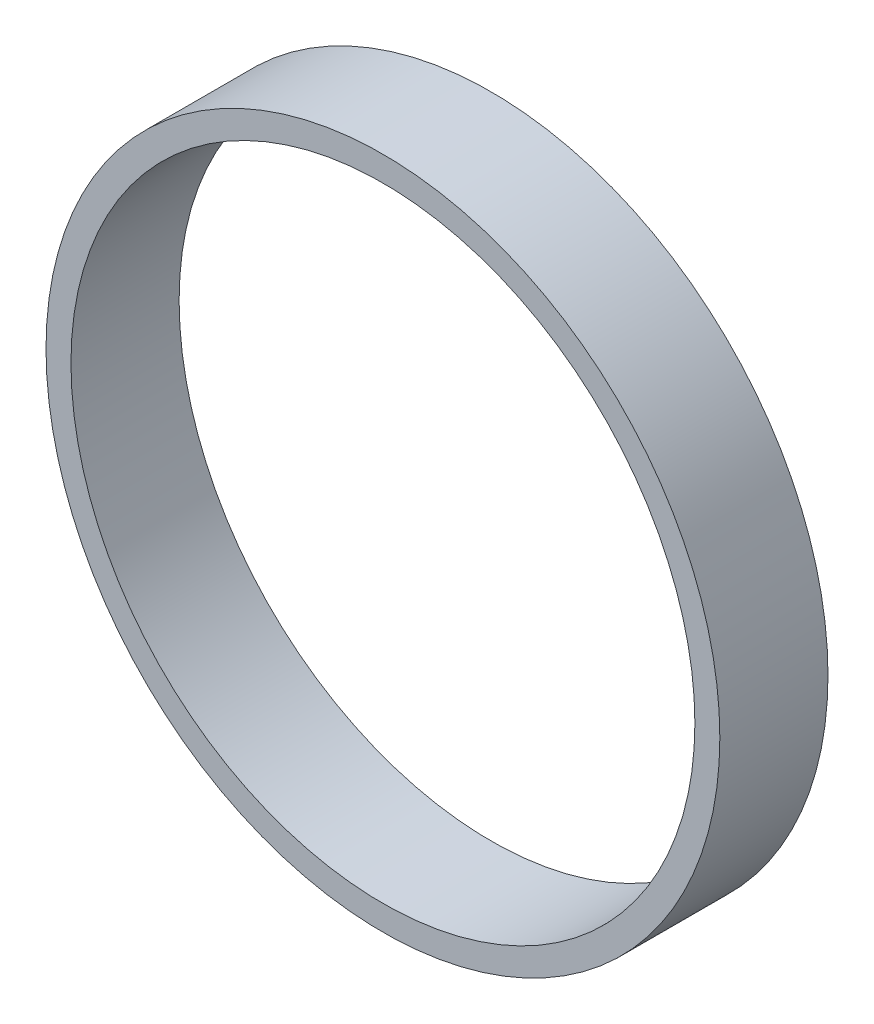
ISO-10303-21;
HEADER;
FILE_DESCRIPTION(('STEP AP214'),'2;1');
FILE_NAME('part.step','',(''),(''),'','','');
FILE_SCHEMA(('AUTOMOTIVE_DESIGN { 1 0 10303 214 1 1 1 1 }'));
ENDSEC;
DATA;
#1=APPLICATION_CONTEXT('core data for automotive mechanical design processes');
#2=APPLICATION_PROTOCOL_DEFINITION('international standard','automotive_design',2000,#1);
#3=PRODUCT_CONTEXT('',#1,'mechanical');
#4=PRODUCT('Part','Part','',(#3));
#5=PRODUCT_RELATED_PRODUCT_CATEGORY('part','',(#4));
#6=PRODUCT_DEFINITION_FORMATION('','',#4);
#7=PRODUCT_DEFINITION_CONTEXT('part definition',#1,'design');
#8=PRODUCT_DEFINITION('design','',#6,#7);
#9=PRODUCT_DEFINITION_SHAPE('','',#8);
#10=(LENGTH_UNIT() NAMED_UNIT(*) SI_UNIT(.MILLI.,.METRE.));
#11=(NAMED_UNIT(*) PLANE_ANGLE_UNIT() SI_UNIT($,.RADIAN.));
#12=(NAMED_UNIT(*) SI_UNIT($,.STERADIAN.) SOLID_ANGLE_UNIT());
#13=UNCERTAINTY_MEASURE_WITH_UNIT(LENGTH_MEASURE(1.E-05),#10,'distance_accuracy_value','');
#14=(GEOMETRIC_REPRESENTATION_CONTEXT(3) GLOBAL_UNCERTAINTY_ASSIGNED_CONTEXT((#13)) GLOBAL_UNIT_ASSIGNED_CONTEXT((#10,
#11,#12)) REPRESENTATION_CONTEXT('',''));
#15=CARTESIAN_POINT('',(0.,0.,0.));
#16=DIRECTION('',(0.,0.,1.));
#17=DIRECTION('',(1.,0.,0.));
#18=AXIS2_PLACEMENT_3D('',#15,#16,#17);
#19=CARTESIAN_POINT('',(0.,0.,3.302));
#20=DIRECTION('',(0.,0.,-1.));
#21=DIRECTION('',(-1.,0.,0.));
#22=AXIS2_PLACEMENT_3D('',#19,#20,#21);
#23=CYLINDRICAL_SURFACE('',#22,10.287);
#24=CARTESIAN_POINT('',(0.,0.,3.302));
#25=DIRECTION('',(0.,0.,1.));
#26=DIRECTION('',(1.,0.,0.));
#27=AXIS2_PLACEMENT_3D('',#24,#25,#26);
#28=CIRCLE('',#27,10.287);
#29=CARTESIAN_POINT('',(10.287,0.,3.302));
#30=VERTEX_POINT('',#29);
#31=EDGE_CURVE('E10',#30,#30,#28,.T.);
#32=ORIENTED_EDGE('',*,*,#31,.F.);
#33=EDGE_LOOP('',(#32));
#34=FACE_BOUND('',#33,.T.);
#35=CARTESIAN_POINT('',(0.,0.,0.));
#36=DIRECTION('',(0.,0.,1.));
#37=DIRECTION('',(1.,0.,0.));
#38=AXIS2_PLACEMENT_3D('',#35,#36,#37);
#39=CIRCLE('',#38,10.287);
#40=CARTESIAN_POINT('',(10.287,0.,0.));
#41=VERTEX_POINT('',#40);
#42=EDGE_CURVE('E33',#41,#41,#39,.T.);
#43=ORIENTED_EDGE('',*,*,#42,.T.);
#44=EDGE_LOOP('',(#43));
#45=FACE_BOUND('',#44,.T.);
#46=ADVANCED_FACE('F30',(#34,#45),#23,.T.);
#47=CARTESIAN_POINT('',(0.,0.,3.302));
#48=DIRECTION('',(0.,0.,1.));
#49=DIRECTION('',(1.,0.,0.));
#50=AXIS2_PLACEMENT_3D('',#47,#48,#49);
#51=PLANE('',#50);
#52=CARTESIAN_POINT('',(0.,0.,3.302));
#53=DIRECTION('',(0.,0.,1.));
#54=DIRECTION('',(1.,0.,0.));
#55=AXIS2_PLACEMENT_3D('',#52,#53,#54);
#56=CIRCLE('',#55,9.525);
#57=CARTESIAN_POINT('',(9.525,0.,3.302));
#58=VERTEX_POINT('',#57);
#59=EDGE_CURVE('E42',#58,#58,#56,.T.);
#60=ORIENTED_EDGE('',*,*,#59,.F.);
#61=EDGE_LOOP('',(#60));
#62=FACE_BOUND('',#61,.T.);
#63=ORIENTED_EDGE('',*,*,#31,.T.);
#64=EDGE_LOOP('',(#63));
#65=FACE_BOUND('',#64,.T.);
#66=ADVANCED_FACE('F57',(#62,#65),#51,.T.);
#67=CARTESIAN_POINT('',(0.,0.,0.));
#68=DIRECTION('',(0.,0.,1.));
#69=DIRECTION('',(1.,0.,0.));
#70=AXIS2_PLACEMENT_3D('',#67,#68,#69);
#71=PLANE('',#70);
#72=CARTESIAN_POINT('',(0.,0.,0.));
#73=DIRECTION('',(0.,0.,1.));
#74=DIRECTION('',(1.,0.,0.));
#75=AXIS2_PLACEMENT_3D('',#72,#73,#74);
#76=CIRCLE('',#75,9.525);
#77=CARTESIAN_POINT('',(9.525,0.,0.));
#78=VERTEX_POINT('',#77);
#79=EDGE_CURVE('E40',#78,#78,#76,.T.);
#80=ORIENTED_EDGE('',*,*,#79,.T.);
#81=EDGE_LOOP('',(#80));
#82=FACE_BOUND('',#81,.T.);
#83=ORIENTED_EDGE('',*,*,#42,.F.);
#84=EDGE_LOOP('',(#83));
#85=FACE_BOUND('',#84,.T.);
#86=ADVANCED_FACE('F48',(#82,#85),#71,.F.);
#87=CARTESIAN_POINT('',(0.,0.,0.));
#88=DIRECTION('',(0.,0.,1.));
#89=DIRECTION('',(1.,0.,0.));
#90=AXIS2_PLACEMENT_3D('',#87,#88,#89);
#91=CYLINDRICAL_SURFACE('',#90,9.525);
#92=ORIENTED_EDGE('',*,*,#79,.F.);
#93=EDGE_LOOP('',(#92));
#94=FACE_BOUND('',#93,.T.);
#95=ORIENTED_EDGE('',*,*,#59,.T.);
#96=EDGE_LOOP('',(#95));
#97=FACE_BOUND('',#96,.T.);
#98=ADVANCED_FACE('F51',(#94,#97),#91,.F.);
#99=CLOSED_SHELL('',(#46,#66,#86,#98));
#100=MANIFOLD_SOLID_BREP('B2',#99);
#101=ADVANCED_BREP_SHAPE_REPRESENTATION('',(#18,#100),#14);
#102=SHAPE_DEFINITION_REPRESENTATION(#9,#101);
ENDSEC;
END-ISO-10303-21;
